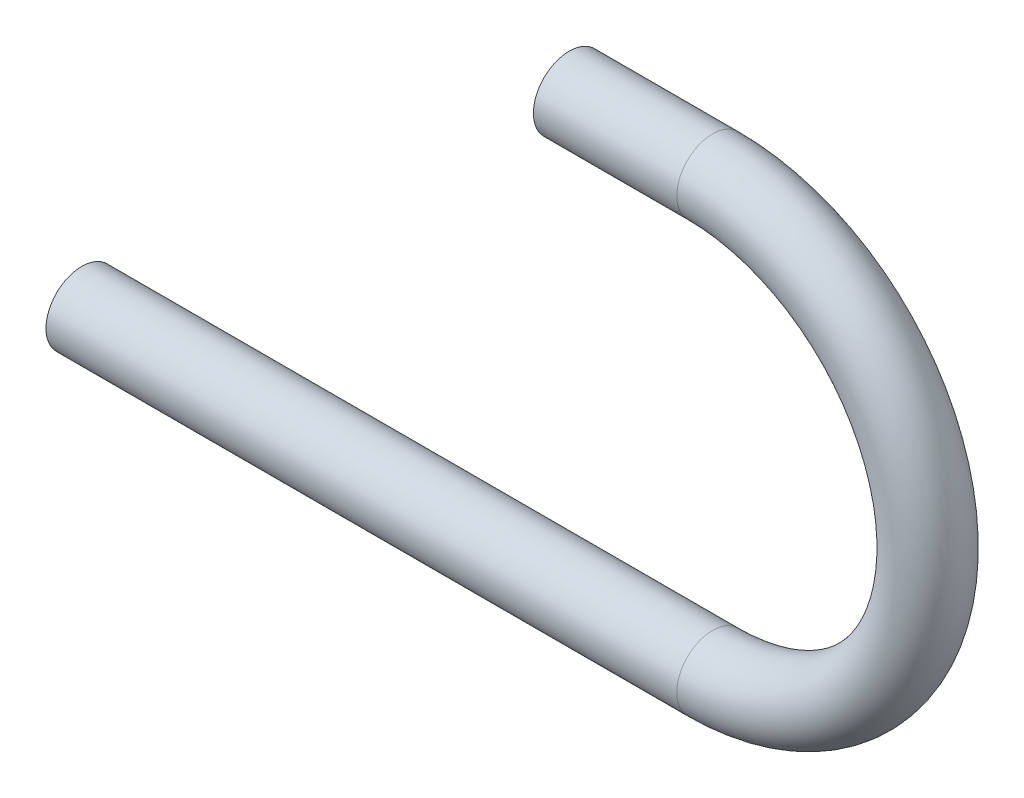
ISO-10303-21;
HEADER;
FILE_DESCRIPTION(('STEP AP214'),'2;1');
FILE_NAME('part.step','',(''),(''),'','','');
FILE_SCHEMA(('AUTOMOTIVE_DESIGN { 1 0 10303 214 1 1 1 1 }'));
ENDSEC;
DATA;
#1=APPLICATION_CONTEXT('core data for automotive mechanical design processes');
#2=APPLICATION_PROTOCOL_DEFINITION('international standard','automotive_design',2000,#1);
#3=PRODUCT_CONTEXT('',#1,'mechanical');
#4=PRODUCT('Part','Part','',(#3));
#5=PRODUCT_RELATED_PRODUCT_CATEGORY('part','',(#4));
#6=PRODUCT_DEFINITION_FORMATION('','',#4);
#7=PRODUCT_DEFINITION_CONTEXT('part definition',#1,'design');
#8=PRODUCT_DEFINITION('design','',#6,#7);
#9=PRODUCT_DEFINITION_SHAPE('','',#8);
#10=(LENGTH_UNIT() NAMED_UNIT(*) SI_UNIT(.MILLI.,.METRE.));
#11=(NAMED_UNIT(*) PLANE_ANGLE_UNIT() SI_UNIT($,.RADIAN.));
#12=(NAMED_UNIT(*) SI_UNIT($,.STERADIAN.) SOLID_ANGLE_UNIT());
#13=UNCERTAINTY_MEASURE_WITH_UNIT(LENGTH_MEASURE(1.E-05),#10,'distance_accuracy_value','');
#14=(GEOMETRIC_REPRESENTATION_CONTEXT(3) GLOBAL_UNCERTAINTY_ASSIGNED_CONTEXT((#13)) GLOBAL_UNIT_ASSIGNED_CONTEXT((#10,
#11,#12)) REPRESENTATION_CONTEXT('',''));
#15=CARTESIAN_POINT('',(0.,0.,0.));
#16=DIRECTION('',(0.,0.,1.));
#17=DIRECTION('',(1.,0.,0.));
#18=AXIS2_PLACEMENT_3D('',#15,#16,#17);
#19=CARTESIAN_POINT('',(-6.8525950466657,34.4611719990288,0.));
#20=DIRECTION('',(1.,0.,0.));
#21=DIRECTION('',(0.,0.,-1.));
#22=AXIS2_PLACEMENT_3D('',#19,#20,#21);
#23=CYLINDRICAL_SURFACE('',#22,6.35);
#24=CARTESIAN_POINT('',(18.5474049533343,34.4611719990288,0.));
#25=DIRECTION('',(1.,0.,0.));
#26=DIRECTION('',(0.,0.,-1.));
#27=AXIS2_PLACEMENT_3D('',#24,#25,#26);
#28=CIRCLE('',#27,6.35);
#29=CARTESIAN_POINT('',(18.5474049533343,40.8111719990288,0.));
#30=VERTEX_POINT('',#29);
#31=EDGE_CURVE('E64',#30,#30,#28,.T.);
#32=ORIENTED_EDGE('',*,*,#31,.F.);
#33=EDGE_LOOP('',(#32));
#34=FACE_BOUND('',#33,.T.);
#35=CARTESIAN_POINT('',(-6.8525950466657,34.4611719990288,0.));
#36=DIRECTION('',(1.,0.,0.));
#37=DIRECTION('',(0.,0.,-1.));
#38=AXIS2_PLACEMENT_3D('',#35,#36,#37);
#39=CIRCLE('',#38,6.35);
#40=CARTESIAN_POINT('',(-6.8525950466657,34.4611719990288,-6.35));
#41=VERTEX_POINT('',#40);
#42=EDGE_CURVE('E61',#41,#41,#39,.T.);
#43=ORIENTED_EDGE('',*,*,#42,.T.);
#44=EDGE_LOOP('',(#43));
#45=FACE_BOUND('',#44,.T.);
#46=ADVANCED_FACE('F37',(#34,#45),#23,.T.);
#47=CARTESIAN_POINT('',(18.5474049533343,-3.63882800097116,0.));
#48=DIRECTION('',(0.,0.,-1.));
#49=DIRECTION('',(-1.,0.,0.));
#50=AXIS2_PLACEMENT_3D('',#47,#48,#49);
#51=TOROIDAL_SURFACE('',#50,38.1,6.35);
#52=CARTESIAN_POINT('',(18.5474049533343,-41.7388280009712,0.));
#53=DIRECTION('',(-1.,0.,0.));
#54=DIRECTION('',(0.,0.,-1.));
#55=AXIS2_PLACEMENT_3D('',#52,#53,#54);
#56=CIRCLE('',#55,6.35);
#57=CARTESIAN_POINT('',(18.5474049533343,-48.0888280009712,0.));
#58=VERTEX_POINT('',#57);
#59=EDGE_CURVE('E41',#58,#58,#56,.T.);
#60=CARTESIAN_POINT('',(18.5474049533343,-3.63882800097116,0.));
#61=DIRECTION('',(0.,0.,-1.));
#62=DIRECTION('',(-1.,0.,0.));
#63=AXIS2_PLACEMENT_3D('',#60,#61,#62);
#64=CIRCLE('',#63,44.45);
#65=EDGE_CURVE('',#30,#58,#64,.T.);
#66=ORIENTED_EDGE('',*,*,#31,.T.);
#67=ORIENTED_EDGE('',*,*,#59,.F.);
#68=ORIENTED_EDGE('',*,*,#65,.T.);
#69=ORIENTED_EDGE('',*,*,#65,.F.);
#70=EDGE_LOOP('',(#66,#68,#67,#69));
#71=FACE_BOUND('',#70,.T.);
#72=ADVANCED_FACE('F74',(#71),#51,.T.);
#73=CARTESIAN_POINT('',(18.5474049533343,-41.7388280009712,0.));
#74=DIRECTION('',(-1.,0.,0.));
#75=DIRECTION('',(0.,-1.,0.));
#76=AXIS2_PLACEMENT_3D('',#73,#74,#75);
#77=CYLINDRICAL_SURFACE('',#76,6.35);
#78=CARTESIAN_POINT('',(-93.2125950466657,-41.7388280009712,0.));
#79=DIRECTION('',(-1.,0.,0.));
#80=DIRECTION('',(0.,0.,-1.));
#81=AXIS2_PLACEMENT_3D('',#78,#79,#80);
#82=CIRCLE('',#81,6.35);
#83=CARTESIAN_POINT('',(-93.2125950466657,-41.7388280009712,-6.35));
#84=VERTEX_POINT('',#83);
#85=EDGE_CURVE('E56',#84,#84,#82,.T.);
#86=ORIENTED_EDGE('',*,*,#85,.F.);
#87=EDGE_LOOP('',(#86));
#88=FACE_BOUND('',#87,.T.);
#89=ORIENTED_EDGE('',*,*,#59,.T.);
#90=EDGE_LOOP('',(#89));
#91=FACE_BOUND('',#90,.T.);
#92=ADVANCED_FACE('F39',(#88,#91),#77,.T.);
#93=CARTESIAN_POINT('',(-6.8525950466657,34.4611719990288,0.));
#94=DIRECTION('',(1.,0.,0.));
#95=DIRECTION('',(0.,0.,-1.));
#96=AXIS2_PLACEMENT_3D('',#93,#94,#95);
#97=PLANE('',#96);
#98=CARTESIAN_POINT('',(-6.8525950466657,34.4611719990288,0.));
#99=DIRECTION('',(1.,0.,0.));
#100=DIRECTION('',(0.,0.,-1.));
#101=AXIS2_PLACEMENT_3D('',#98,#99,#100);
#102=CIRCLE('',#101,5.588);
#103=CARTESIAN_POINT('',(-6.8525950466657,34.4611719990288,-5.588));
#104=VERTEX_POINT('',#103);
#105=EDGE_CURVE('E60',#104,#104,#102,.F.);
#106=ORIENTED_EDGE('',*,*,#105,.F.);
#107=EDGE_LOOP('',(#106));
#108=FACE_BOUND('',#107,.T.);
#109=ORIENTED_EDGE('',*,*,#42,.F.);
#110=EDGE_LOOP('',(#109));
#111=FACE_BOUND('',#110,.T.);
#112=ADVANCED_FACE('F80',(#108,#111),#97,.F.);
#113=CARTESIAN_POINT('',(-93.2125950466657,-41.7388280009712,0.));
#114=DIRECTION('',(-1.,0.,0.));
#115=DIRECTION('',(0.,0.,-1.));
#116=AXIS2_PLACEMENT_3D('',#113,#114,#115);
#117=PLANE('',#116);
#118=CARTESIAN_POINT('',(-93.2125950466657,-41.7388280009712,0.));
#119=DIRECTION('',(-1.,0.,0.));
#120=DIRECTION('',(0.,0.,-1.));
#121=AXIS2_PLACEMENT_3D('',#118,#119,#120);
#122=CIRCLE('',#121,5.588);
#123=CARTESIAN_POINT('',(-93.2125950466657,-41.7388280009712,-5.588));
#124=VERTEX_POINT('',#123);
#125=EDGE_CURVE('E10',#124,#124,#122,.F.);
#126=ORIENTED_EDGE('',*,*,#125,.T.);
#127=EDGE_LOOP('',(#126));
#128=FACE_BOUND('',#127,.T.);
#129=ORIENTED_EDGE('',*,*,#85,.T.);
#130=EDGE_LOOP('',(#129));
#131=FACE_BOUND('',#130,.T.);
#132=ADVANCED_FACE('F98',(#128,#131),#117,.T.);
#133=CARTESIAN_POINT('',(-6.8525950466657,34.4611719990288,0.));
#134=DIRECTION('',(1.,0.,0.));
#135=DIRECTION('',(0.,0.,-1.));
#136=AXIS2_PLACEMENT_3D('',#133,#134,#135);
#137=CYLINDRICAL_SURFACE('',#136,5.588);
#138=CARTESIAN_POINT('',(18.5474049533343,34.4611719990288,0.));
#139=DIRECTION('',(1.,0.,0.));
#140=DIRECTION('',(0.,0.,-1.));
#141=AXIS2_PLACEMENT_3D('',#138,#139,#140);
#142=CIRCLE('',#141,5.588);
#143=CARTESIAN_POINT('',(18.5474049533343,40.0491719990288,0.));
#144=VERTEX_POINT('',#143);
#145=EDGE_CURVE('E52',#144,#144,#142,.F.);
#146=ORIENTED_EDGE('',*,*,#145,.F.);
#147=EDGE_LOOP('',(#146));
#148=FACE_BOUND('',#147,.T.);
#149=ORIENTED_EDGE('',*,*,#105,.T.);
#150=EDGE_LOOP('',(#149));
#151=FACE_BOUND('',#150,.T.);
#152=ADVANCED_FACE('F92',(#148,#151),#137,.F.);
#153=CARTESIAN_POINT('',(18.5474049533343,-3.63882800097116,0.));
#154=DIRECTION('',(0.,0.,-1.));
#155=DIRECTION('',(-1.,0.,0.));
#156=AXIS2_PLACEMENT_3D('',#153,#154,#155);
#157=TOROIDAL_SURFACE('',#156,38.1,5.588);
#158=CARTESIAN_POINT('',(18.5474049533343,-41.7388280009712,0.));
#159=DIRECTION('',(-1.,0.,0.));
#160=DIRECTION('',(0.,0.,-1.));
#161=AXIS2_PLACEMENT_3D('',#158,#159,#160);
#162=CIRCLE('',#161,5.588);
#163=CARTESIAN_POINT('',(18.5474049533343,-47.3268280009712,0.));
#164=VERTEX_POINT('',#163);
#165=EDGE_CURVE('E46',#164,#164,#162,.F.);
#166=CARTESIAN_POINT('',(18.5474049533343,-3.63882800097116,0.));
#167=DIRECTION('',(0.,0.,-1.));
#168=DIRECTION('',(-1.,0.,0.));
#169=AXIS2_PLACEMENT_3D('',#166,#167,#168);
#170=CIRCLE('',#169,43.688);
#171=EDGE_CURVE('',#144,#164,#170,.T.);
#172=ORIENTED_EDGE('',*,*,#145,.T.);
#173=ORIENTED_EDGE('',*,*,#165,.F.);
#174=ORIENTED_EDGE('',*,*,#171,.T.);
#175=ORIENTED_EDGE('',*,*,#171,.F.);
#176=EDGE_LOOP('',(#172,#174,#173,#175));
#177=FACE_BOUND('',#176,.T.);
#178=ADVANCED_FACE('F86',(#177),#157,.F.);
#179=CARTESIAN_POINT('',(18.5474049533343,-41.7388280009712,0.));
#180=DIRECTION('',(-1.,0.,0.));
#181=DIRECTION('',(0.,-1.,0.));
#182=AXIS2_PLACEMENT_3D('',#179,#180,#181);
#183=CYLINDRICAL_SURFACE('',#182,5.588);
#184=ORIENTED_EDGE('',*,*,#125,.F.);
#185=EDGE_LOOP('',(#184));
#186=FACE_BOUND('',#185,.T.);
#187=ORIENTED_EDGE('',*,*,#165,.T.);
#188=EDGE_LOOP('',(#187));
#189=FACE_BOUND('',#188,.T.);
#190=ADVANCED_FACE('F84',(#186,#189),#183,.F.);
#191=CLOSED_SHELL('',(#46,#72,#92,#112,#132,#152,#178,#190));
#192=MANIFOLD_SOLID_BREP('B2',#191);
#193=ADVANCED_BREP_SHAPE_REPRESENTATION('',(#18,#192),#14);
#194=SHAPE_DEFINITION_REPRESENTATION(#9,#193);
ENDSEC;
END-ISO-10303-21;
